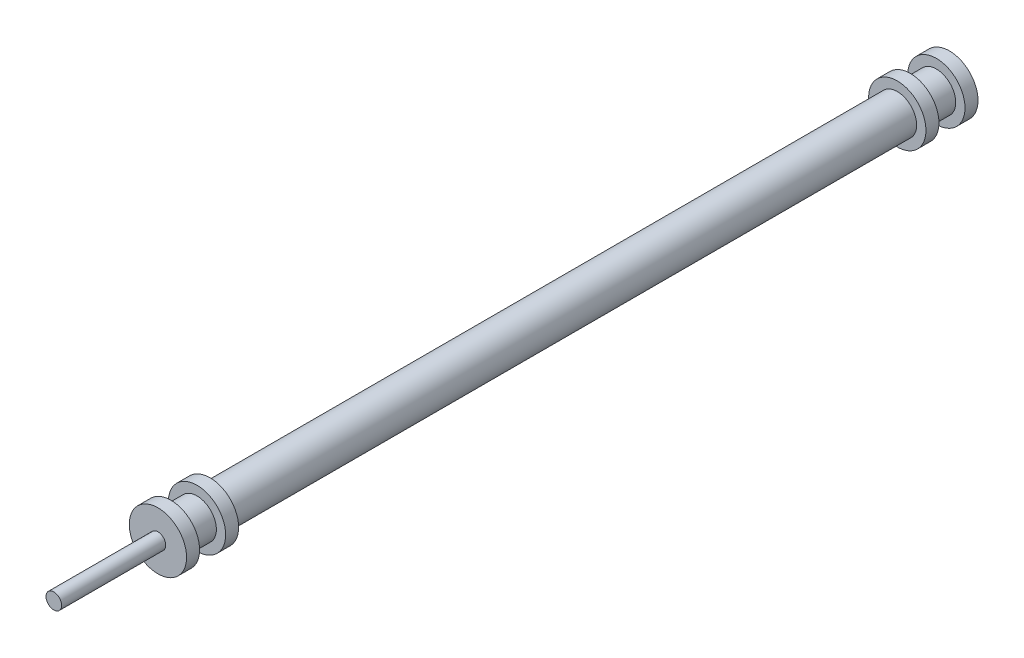
ISO-10303-21;
HEADER;
FILE_DESCRIPTION(('STEP AP214'),'2;1');
FILE_NAME('part.step','',(''),(''),'','','');
FILE_SCHEMA(('AUTOMOTIVE_DESIGN { 1 0 10303 214 1 1 1 1 }'));
ENDSEC;
DATA;
#1=APPLICATION_CONTEXT('core data for automotive mechanical design processes');
#2=APPLICATION_PROTOCOL_DEFINITION('international standard','automotive_design',2000,#1);
#3=PRODUCT_CONTEXT('',#1,'mechanical');
#4=PRODUCT('Part','Part','',(#3));
#5=PRODUCT_RELATED_PRODUCT_CATEGORY('part','',(#4));
#6=PRODUCT_DEFINITION_FORMATION('','',#4);
#7=PRODUCT_DEFINITION_CONTEXT('part definition',#1,'design');
#8=PRODUCT_DEFINITION('design','',#6,#7);
#9=PRODUCT_DEFINITION_SHAPE('','',#8);
#10=(LENGTH_UNIT() NAMED_UNIT(*) SI_UNIT(.MILLI.,.METRE.));
#11=(NAMED_UNIT(*) PLANE_ANGLE_UNIT() SI_UNIT($,.RADIAN.));
#12=(NAMED_UNIT(*) SI_UNIT($,.STERADIAN.) SOLID_ANGLE_UNIT());
#13=UNCERTAINTY_MEASURE_WITH_UNIT(LENGTH_MEASURE(1.E-05),#10,'distance_accuracy_value','');
#14=(GEOMETRIC_REPRESENTATION_CONTEXT(3) GLOBAL_UNCERTAINTY_ASSIGNED_CONTEXT((#13)) GLOBAL_UNIT_ASSIGNED_CONTEXT((#10,
#11,#12)) REPRESENTATION_CONTEXT('',''));
#15=CARTESIAN_POINT('',(0.,0.,0.));
#16=DIRECTION('',(0.,0.,1.));
#17=DIRECTION('',(1.,0.,0.));
#18=AXIS2_PLACEMENT_3D('',#15,#16,#17);
#19=CARTESIAN_POINT('',(0.,0.,132.));
#20=DIRECTION('',(0.,0.,-1.));
#21=DIRECTION('',(-1.,0.,0.));
#22=AXIS2_PLACEMENT_3D('',#19,#20,#21);
#23=CYLINDRICAL_SURFACE('',#22,3.725);
#24=CARTESIAN_POINT('',(0.,0.,132.));
#25=DIRECTION('',(0.,0.,1.));
#26=DIRECTION('',(1.,0.,0.));
#27=AXIS2_PLACEMENT_3D('',#24,#25,#26);
#28=CIRCLE('',#27,3.725);
#29=CARTESIAN_POINT('',(3.725,0.,132.));
#30=VERTEX_POINT('',#29);
#31=EDGE_CURVE('E45',#30,#30,#28,.T.);
#32=ORIENTED_EDGE('',*,*,#31,.F.);
#33=EDGE_LOOP('',(#32));
#34=FACE_BOUND('',#33,.T.);
#35=CARTESIAN_POINT('',(0.,0.,0.));
#36=DIRECTION('',(0.,0.,1.));
#37=DIRECTION('',(1.,0.,0.));
#38=AXIS2_PLACEMENT_3D('',#35,#36,#37);
#39=CIRCLE('',#38,3.725);
#40=CARTESIAN_POINT('',(3.725,0.,0.));
#41=VERTEX_POINT('',#40);
#42=EDGE_CURVE('E36',#41,#41,#39,.T.);
#43=ORIENTED_EDGE('',*,*,#42,.T.);
#44=EDGE_LOOP('',(#43));
#45=FACE_BOUND('',#44,.T.);
#46=ADVANCED_FACE('F33',(#34,#45),#23,.T.);
#47=CARTESIAN_POINT('',(0.,0.,134.5));
#48=DIRECTION('',(0.,0.,-1.));
#49=DIRECTION('',(-1.,0.,0.));
#50=AXIS2_PLACEMENT_3D('',#47,#48,#49);
#51=CYLINDRICAL_SURFACE('',#50,5.5);
#52=CARTESIAN_POINT('',(0.,0.,134.5));
#53=DIRECTION('',(0.,0.,1.));
#54=DIRECTION('',(1.,0.,0.));
#55=AXIS2_PLACEMENT_3D('',#52,#53,#54);
#56=CIRCLE('',#55,5.5);
#57=CARTESIAN_POINT('',(5.5,0.,134.5));
#58=VERTEX_POINT('',#57);
#59=EDGE_CURVE('E78',#58,#58,#56,.T.);
#60=ORIENTED_EDGE('',*,*,#59,.F.);
#61=EDGE_LOOP('',(#60));
#62=FACE_BOUND('',#61,.T.);
#63=CARTESIAN_POINT('',(0.,0.,132.));
#64=DIRECTION('',(0.,0.,1.));
#65=DIRECTION('',(1.,0.,0.));
#66=AXIS2_PLACEMENT_3D('',#63,#64,#65);
#67=CIRCLE('',#66,5.5);
#68=CARTESIAN_POINT('',(5.5,0.,132.));
#69=VERTEX_POINT('',#68);
#70=EDGE_CURVE('E76',#69,#69,#67,.T.);
#71=ORIENTED_EDGE('',*,*,#70,.T.);
#72=EDGE_LOOP('',(#71));
#73=FACE_BOUND('',#72,.T.);
#74=ADVANCED_FACE('F90',(#62,#73),#51,.T.);
#75=CARTESIAN_POINT('',(0.,0.,134.5));
#76=DIRECTION('',(0.,0.,1.));
#77=DIRECTION('',(1.,0.,0.));
#78=AXIS2_PLACEMENT_3D('',#75,#76,#77);
#79=PLANE('',#78);
#80=CARTESIAN_POINT('',(0.,0.,134.5));
#81=DIRECTION('',(0.,0.,1.));
#82=DIRECTION('',(1.,0.,0.));
#83=AXIS2_PLACEMENT_3D('',#80,#81,#82);
#84=CIRCLE('',#83,3.725);
#85=CARTESIAN_POINT('',(3.725,0.,134.5));
#86=VERTEX_POINT('',#85);
#87=EDGE_CURVE('E40',#86,#86,#84,.T.);
#88=ORIENTED_EDGE('',*,*,#87,.F.);
#89=EDGE_LOOP('',(#88));
#90=FACE_BOUND('',#89,.T.);
#91=ORIENTED_EDGE('',*,*,#59,.T.);
#92=EDGE_LOOP('',(#91));
#93=FACE_BOUND('',#92,.T.);
#94=ADVANCED_FACE('F128',(#90,#93),#79,.T.);
#95=CARTESIAN_POINT('',(0.,0.,132.));
#96=DIRECTION('',(0.,0.,1.));
#97=DIRECTION('',(1.,0.,0.));
#98=AXIS2_PLACEMENT_3D('',#95,#96,#97);
#99=PLANE('',#98);
#100=ORIENTED_EDGE('',*,*,#31,.T.);
#101=EDGE_LOOP('',(#100));
#102=FACE_BOUND('',#101,.T.);
#103=ORIENTED_EDGE('',*,*,#70,.F.);
#104=EDGE_LOOP('',(#103));
#105=FACE_BOUND('',#104,.T.);
#106=ADVANCED_FACE('F85',(#102,#105),#99,.F.);
#107=CARTESIAN_POINT('',(0.,0.,139.5));
#108=DIRECTION('',(0.,0.,-1.));
#109=DIRECTION('',(-1.,0.,0.));
#110=AXIS2_PLACEMENT_3D('',#107,#108,#109);
#111=CYLINDRICAL_SURFACE('',#110,3.725);
#112=CARTESIAN_POINT('',(0.,0.,139.5));
#113=DIRECTION('',(0.,0.,1.));
#114=DIRECTION('',(1.,0.,0.));
#115=AXIS2_PLACEMENT_3D('',#112,#113,#114);
#116=CIRCLE('',#115,3.725);
#117=CARTESIAN_POINT('',(3.725,0.,139.5));
#118=VERTEX_POINT('',#117);
#119=EDGE_CURVE('E71',#118,#118,#116,.T.);
#120=ORIENTED_EDGE('',*,*,#119,.F.);
#121=EDGE_LOOP('',(#120));
#122=FACE_BOUND('',#121,.T.);
#123=ORIENTED_EDGE('',*,*,#87,.T.);
#124=EDGE_LOOP('',(#123));
#125=FACE_BOUND('',#124,.T.);
#126=ADVANCED_FACE('F123',(#122,#125),#111,.T.);
#127=CARTESIAN_POINT('',(0.,0.,142.));
#128=DIRECTION('',(0.,0.,-1.));
#129=DIRECTION('',(-1.,0.,0.));
#130=AXIS2_PLACEMENT_3D('',#127,#128,#129);
#131=CYLINDRICAL_SURFACE('',#130,5.5);
#132=CARTESIAN_POINT('',(0.,0.,142.));
#133=DIRECTION('',(0.,0.,1.));
#134=DIRECTION('',(1.,0.,0.));
#135=AXIS2_PLACEMENT_3D('',#132,#133,#134);
#136=CIRCLE('',#135,5.5);
#137=CARTESIAN_POINT('',(5.5,0.,142.));
#138=VERTEX_POINT('',#137);
#139=EDGE_CURVE('E68',#138,#138,#136,.T.);
#140=ORIENTED_EDGE('',*,*,#139,.F.);
#141=EDGE_LOOP('',(#140));
#142=FACE_BOUND('',#141,.T.);
#143=CARTESIAN_POINT('',(0.,0.,139.5));
#144=DIRECTION('',(0.,0.,1.));
#145=DIRECTION('',(1.,0.,0.));
#146=AXIS2_PLACEMENT_3D('',#143,#144,#145);
#147=CIRCLE('',#146,5.5);
#148=CARTESIAN_POINT('',(5.5,0.,139.5));
#149=VERTEX_POINT('',#148);
#150=EDGE_CURVE('E72',#149,#149,#147,.T.);
#151=ORIENTED_EDGE('',*,*,#150,.T.);
#152=EDGE_LOOP('',(#151));
#153=FACE_BOUND('',#152,.T.);
#154=ADVANCED_FACE('F118',(#142,#153),#131,.T.);
#155=CARTESIAN_POINT('',(0.,0.,142.));
#156=DIRECTION('',(0.,0.,1.));
#157=DIRECTION('',(1.,0.,0.));
#158=AXIS2_PLACEMENT_3D('',#155,#156,#157);
#159=PLANE('',#158);
#160=CARTESIAN_POINT('',(0.,0.,142.));
#161=DIRECTION('',(0.,0.,1.));
#162=DIRECTION('',(1.,0.,0.));
#163=AXIS2_PLACEMENT_3D('',#160,#161,#162);
#164=CIRCLE('',#163,1.5);
#165=CARTESIAN_POINT('',(1.5,0.,142.));
#166=VERTEX_POINT('',#165);
#167=EDGE_CURVE('E10',#166,#166,#164,.T.);
#168=ORIENTED_EDGE('',*,*,#167,.F.);
#169=EDGE_LOOP('',(#168));
#170=FACE_BOUND('',#169,.T.);
#171=ORIENTED_EDGE('',*,*,#139,.T.);
#172=EDGE_LOOP('',(#171));
#173=FACE_BOUND('',#172,.T.);
#174=ADVANCED_FACE('F113',(#170,#173),#159,.T.);
#175=CARTESIAN_POINT('',(0.,0.,139.5));
#176=DIRECTION('',(0.,0.,1.));
#177=DIRECTION('',(1.,0.,0.));
#178=AXIS2_PLACEMENT_3D('',#175,#176,#177);
#179=PLANE('',#178);
#180=ORIENTED_EDGE('',*,*,#119,.T.);
#181=EDGE_LOOP('',(#180));
#182=FACE_BOUND('',#181,.T.);
#183=ORIENTED_EDGE('',*,*,#150,.F.);
#184=EDGE_LOOP('',(#183));
#185=FACE_BOUND('',#184,.T.);
#186=ADVANCED_FACE('F104',(#182,#185),#179,.F.);
#187=CARTESIAN_POINT('',(0.,0.,-2.5));
#188=DIRECTION('',(0.,0.,1.));
#189=DIRECTION('',(1.,0.,0.));
#190=AXIS2_PLACEMENT_3D('',#187,#188,#189);
#191=CYLINDRICAL_SURFACE('',#190,5.5);
#192=CARTESIAN_POINT('',(0.,0.,-2.5));
#193=DIRECTION('',(0.,0.,1.));
#194=DIRECTION('',(1.,0.,0.));
#195=AXIS2_PLACEMENT_3D('',#192,#193,#194);
#196=CIRCLE('',#195,5.5);
#197=CARTESIAN_POINT('',(5.5,0.,-2.5));
#198=VERTEX_POINT('',#197);
#199=EDGE_CURVE('E63',#198,#198,#196,.T.);
#200=ORIENTED_EDGE('',*,*,#199,.T.);
#201=EDGE_LOOP('',(#200));
#202=FACE_BOUND('',#201,.T.);
#203=CARTESIAN_POINT('',(0.,0.,0.));
#204=DIRECTION('',(0.,0.,1.));
#205=DIRECTION('',(1.,0.,0.));
#206=AXIS2_PLACEMENT_3D('',#203,#204,#205);
#207=CIRCLE('',#206,5.5);
#208=CARTESIAN_POINT('',(5.5,0.,0.));
#209=VERTEX_POINT('',#208);
#210=EDGE_CURVE('E62',#209,#209,#207,.T.);
#211=ORIENTED_EDGE('',*,*,#210,.F.);
#212=EDGE_LOOP('',(#211));
#213=FACE_BOUND('',#212,.T.);
#214=ADVANCED_FACE('F102',(#202,#213),#191,.T.);
#215=CARTESIAN_POINT('',(0.,0.,-2.5));
#216=DIRECTION('',(0.,0.,-1.));
#217=DIRECTION('',(1.,0.,0.));
#218=AXIS2_PLACEMENT_3D('',#215,#216,#217);
#219=PLANE('',#218);
#220=CARTESIAN_POINT('',(0.,0.,-2.5));
#221=DIRECTION('',(0.,0.,1.));
#222=DIRECTION('',(1.,0.,0.));
#223=AXIS2_PLACEMENT_3D('',#220,#221,#222);
#224=CIRCLE('',#223,3.725);
#225=CARTESIAN_POINT('',(3.725,0.,-2.5));
#226=VERTEX_POINT('',#225);
#227=EDGE_CURVE('E59',#226,#226,#224,.T.);
#228=ORIENTED_EDGE('',*,*,#227,.T.);
#229=EDGE_LOOP('',(#228));
#230=FACE_BOUND('',#229,.T.);
#231=ORIENTED_EDGE('',*,*,#199,.F.);
#232=EDGE_LOOP('',(#231));
#233=FACE_BOUND('',#232,.T.);
#234=ADVANCED_FACE('F98',(#230,#233),#219,.T.);
#235=CARTESIAN_POINT('',(0.,0.,0.));
#236=DIRECTION('',(0.,0.,-1.));
#237=DIRECTION('',(1.,0.,0.));
#238=AXIS2_PLACEMENT_3D('',#235,#236,#237);
#239=PLANE('',#238);
#240=ORIENTED_EDGE('',*,*,#42,.F.);
#241=EDGE_LOOP('',(#240));
#242=FACE_BOUND('',#241,.T.);
#243=ORIENTED_EDGE('',*,*,#210,.T.);
#244=EDGE_LOOP('',(#243));
#245=FACE_BOUND('',#244,.T.);
#246=ADVANCED_FACE('F94',(#242,#245),#239,.F.);
#247=CARTESIAN_POINT('',(0.,0.,-7.5));
#248=DIRECTION('',(0.,0.,1.));
#249=DIRECTION('',(1.,0.,0.));
#250=AXIS2_PLACEMENT_3D('',#247,#248,#249);
#251=CYLINDRICAL_SURFACE('',#250,3.725);
#252=CARTESIAN_POINT('',(0.,0.,-7.5));
#253=DIRECTION('',(0.,0.,1.));
#254=DIRECTION('',(1.,0.,0.));
#255=AXIS2_PLACEMENT_3D('',#252,#253,#254);
#256=CIRCLE('',#255,3.725);
#257=CARTESIAN_POINT('',(3.725,0.,-7.5));
#258=VERTEX_POINT('',#257);
#259=EDGE_CURVE('E53',#258,#258,#256,.T.);
#260=ORIENTED_EDGE('',*,*,#259,.T.);
#261=EDGE_LOOP('',(#260));
#262=FACE_BOUND('',#261,.T.);
#263=ORIENTED_EDGE('',*,*,#227,.F.);
#264=EDGE_LOOP('',(#263));
#265=FACE_BOUND('',#264,.T.);
#266=ADVANCED_FACE('F97',(#262,#265),#251,.T.);
#267=CARTESIAN_POINT('',(0.,0.,-10.));
#268=DIRECTION('',(0.,0.,1.));
#269=DIRECTION('',(1.,0.,0.));
#270=AXIS2_PLACEMENT_3D('',#267,#268,#269);
#271=CYLINDRICAL_SURFACE('',#270,5.5);
#272=CARTESIAN_POINT('',(0.,0.,-10.));
#273=DIRECTION('',(0.,0.,1.));
#274=DIRECTION('',(1.,0.,0.));
#275=AXIS2_PLACEMENT_3D('',#272,#273,#274);
#276=CIRCLE('',#275,5.5);
#277=CARTESIAN_POINT('',(5.5,0.,-10.));
#278=VERTEX_POINT('',#277);
#279=EDGE_CURVE('E50',#278,#278,#276,.T.);
#280=ORIENTED_EDGE('',*,*,#279,.T.);
#281=EDGE_LOOP('',(#280));
#282=FACE_BOUND('',#281,.T.);
#283=CARTESIAN_POINT('',(0.,0.,-7.50000000000001));
#284=DIRECTION('',(0.,0.,1.));
#285=DIRECTION('',(1.,0.,0.));
#286=AXIS2_PLACEMENT_3D('',#283,#284,#285);
#287=CIRCLE('',#286,5.5);
#288=CARTESIAN_POINT('',(5.5,0.,-7.50000000000001));
#289=VERTEX_POINT('',#288);
#290=EDGE_CURVE('E54',#289,#289,#287,.T.);
#291=ORIENTED_EDGE('',*,*,#290,.F.);
#292=EDGE_LOOP('',(#291));
#293=FACE_BOUND('',#292,.T.);
#294=ADVANCED_FACE('F194',(#282,#293),#271,.T.);
#295=CARTESIAN_POINT('',(0.,0.,-10.));
#296=DIRECTION('',(0.,0.,-1.));
#297=DIRECTION('',(1.,0.,0.));
#298=AXIS2_PLACEMENT_3D('',#295,#296,#297);
#299=PLANE('',#298);
#300=ORIENTED_EDGE('',*,*,#279,.F.);
#301=EDGE_LOOP('',(#300));
#302=FACE_BOUND('',#301,.T.);
#303=ADVANCED_FACE('F204',(#302),#299,.T.);
#304=CARTESIAN_POINT('',(0.,0.,-7.50000000000001));
#305=DIRECTION('',(0.,0.,-1.));
#306=DIRECTION('',(1.,0.,0.));
#307=AXIS2_PLACEMENT_3D('',#304,#305,#306);
#308=PLANE('',#307);
#309=ORIENTED_EDGE('',*,*,#259,.F.);
#310=EDGE_LOOP('',(#309));
#311=FACE_BOUND('',#310,.T.);
#312=ORIENTED_EDGE('',*,*,#290,.T.);
#313=EDGE_LOOP('',(#312));
#314=FACE_BOUND('',#313,.T.);
#315=ADVANCED_FACE('F213',(#311,#314),#308,.F.);
#316=CARTESIAN_POINT('',(0.,0.,162.));
#317=DIRECTION('',(0.,0.,-1.));
#318=DIRECTION('',(-1.,0.,0.));
#319=AXIS2_PLACEMENT_3D('',#316,#317,#318);
#320=CYLINDRICAL_SURFACE('',#319,1.5);
#321=CARTESIAN_POINT('',(0.,0.,162.));
#322=DIRECTION('',(0.,0.,1.));
#323=DIRECTION('',(1.,0.,0.));
#324=AXIS2_PLACEMENT_3D('',#321,#322,#323);
#325=CIRCLE('',#324,1.5);
#326=CARTESIAN_POINT('',(1.5,0.,162.));
#327=VERTEX_POINT('',#326);
#328=EDGE_CURVE('E49',#327,#327,#325,.T.);
#329=ORIENTED_EDGE('',*,*,#328,.F.);
#330=EDGE_LOOP('',(#329));
#331=FACE_BOUND('',#330,.T.);
#332=ORIENTED_EDGE('',*,*,#167,.T.);
#333=EDGE_LOOP('',(#332));
#334=FACE_BOUND('',#333,.T.);
#335=ADVANCED_FACE('F222',(#331,#334),#320,.T.);
#336=CARTESIAN_POINT('',(0.,0.,162.));
#337=DIRECTION('',(0.,0.,1.));
#338=DIRECTION('',(1.,0.,0.));
#339=AXIS2_PLACEMENT_3D('',#336,#337,#338);
#340=PLANE('',#339);
#341=ORIENTED_EDGE('',*,*,#328,.T.);
#342=EDGE_LOOP('',(#341));
#343=FACE_BOUND('',#342,.T.);
#344=ADVANCED_FACE('F232',(#343),#340,.T.);
#345=CLOSED_SHELL('',(#46,#74,#94,#106,#126,#154,#174,#186,#214,#234,#246,#266,#294,#303,#315,
#335,#344));
#346=MANIFOLD_SOLID_BREP('B2',#345);
#347=ADVANCED_BREP_SHAPE_REPRESENTATION('',(#18,#346),#14);
#348=SHAPE_DEFINITION_REPRESENTATION(#9,#347);
ENDSEC;
END-ISO-10303-21;
